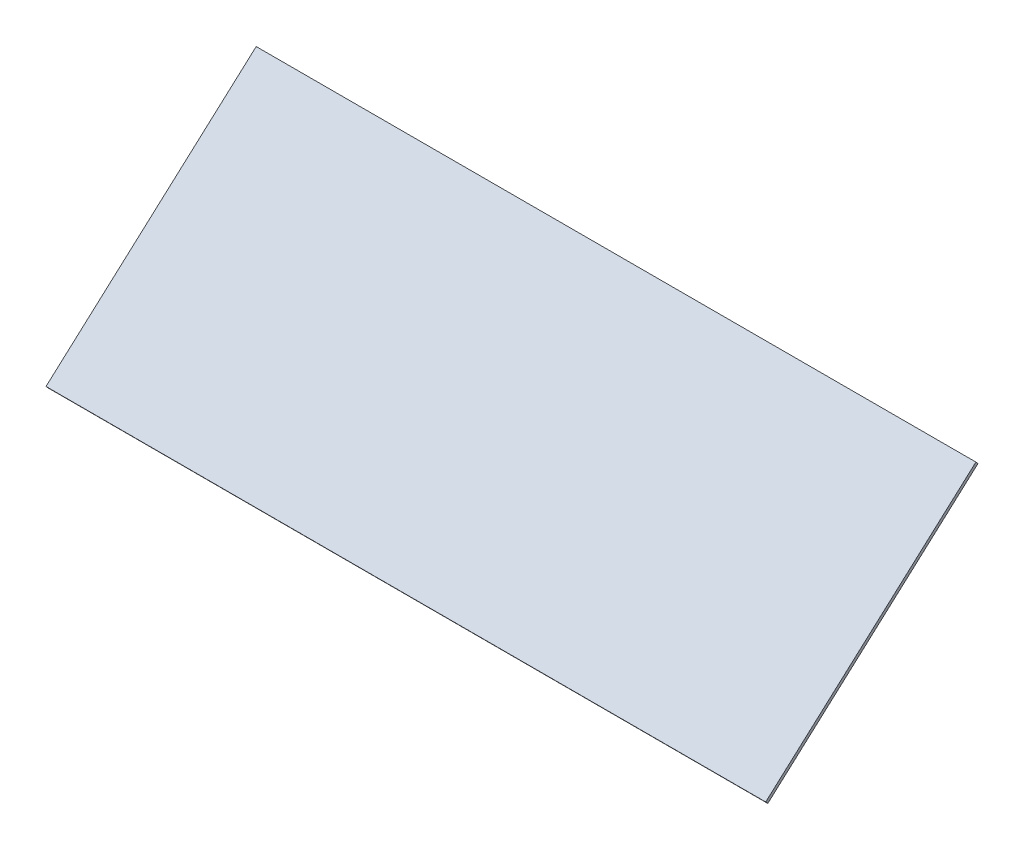
ISO-10303-21;
HEADER;
FILE_DESCRIPTION(('STEP AP214'),'2;1');
FILE_NAME('part.step','',(''),(''),'','','');
FILE_SCHEMA(('AUTOMOTIVE_DESIGN { 1 0 10303 214 1 1 1 1 }'));
ENDSEC;
DATA;
#1=APPLICATION_CONTEXT('core data for automotive mechanical design processes');
#2=APPLICATION_PROTOCOL_DEFINITION('international standard','automotive_design',2000,#1);
#3=PRODUCT_CONTEXT('',#1,'mechanical');
#4=PRODUCT('Part','Part','',(#3));
#5=PRODUCT_RELATED_PRODUCT_CATEGORY('part','',(#4));
#6=PRODUCT_DEFINITION_FORMATION('','',#4);
#7=PRODUCT_DEFINITION_CONTEXT('part definition',#1,'design');
#8=PRODUCT_DEFINITION('design','',#6,#7);
#9=PRODUCT_DEFINITION_SHAPE('','',#8);
#10=(LENGTH_UNIT() NAMED_UNIT(*) SI_UNIT(.MILLI.,.METRE.));
#11=(NAMED_UNIT(*) PLANE_ANGLE_UNIT() SI_UNIT($,.RADIAN.));
#12=(NAMED_UNIT(*) SI_UNIT($,.STERADIAN.) SOLID_ANGLE_UNIT());
#13=UNCERTAINTY_MEASURE_WITH_UNIT(LENGTH_MEASURE(1.E-05),#10,'distance_accuracy_value','');
#14=(GEOMETRIC_REPRESENTATION_CONTEXT(3) GLOBAL_UNCERTAINTY_ASSIGNED_CONTEXT((#13)) GLOBAL_UNIT_ASSIGNED_CONTEXT((#10,
#11,#12)) REPRESENTATION_CONTEXT('',''));
#15=CARTESIAN_POINT('',(0.,0.,0.));
#16=DIRECTION('',(0.,0.,1.));
#17=DIRECTION('',(1.,0.,0.));
#18=AXIS2_PLACEMENT_3D('',#15,#16,#17);
#19=CARTESIAN_POINT('',(114.5,-0.743144825477398,-0.669130606358855));
#20=DIRECTION('',(0.,0.743144825477397,0.669130606358855));
#21=DIRECTION('',(0.,-0.669130606358855,0.743144825477397));
#22=AXIS2_PLACEMENT_3D('',#19,#20,#21);
#23=PLANE('',#22);
#24=DIRECTION('',(0.,0.669130606358855,-0.743144825477398));
#25=VECTOR('',#24,1.);
#26=CARTESIAN_POINT('',(-114.5,-0.743144825477398,-0.669130606358855));
#27=LINE('',#26,#25);
#28=CARTESIAN_POINT('',(-114.5,-0.743144825477398,-0.669130606358855));
#29=VERTEX_POINT('',#28);
#30=CARTESIAN_POINT('',(-114.5,59.4786097468195,-67.5521648993246));
#31=VERTEX_POINT('',#30);
#32=EDGE_CURVE('E102',#29,#31,#27,.T.);
#33=ORIENTED_EDGE('',*,*,#32,.T.);
#34=DIRECTION('',(-1.,0.,0.));
#35=VECTOR('',#34,1.);
#36=CARTESIAN_POINT('',(114.5,59.4786097468195,-67.5521648993246));
#37=LINE('',#36,#35);
#38=CARTESIAN_POINT('',(114.5,59.4786097468195,-67.5521648993246));
#39=VERTEX_POINT('',#38);
#40=EDGE_CURVE('E11',#39,#31,#37,.T.);
#41=ORIENTED_EDGE('',*,*,#40,.F.);
#42=DIRECTION('',(0.,0.669130606358855,-0.743144825477398));
#43=VECTOR('',#42,1.);
#44=CARTESIAN_POINT('',(114.5,-0.743144825477398,-0.669130606358855));
#45=LINE('',#44,#43);
#46=CARTESIAN_POINT('',(114.5,-0.743144825477398,-0.669130606358855));
#47=VERTEX_POINT('',#46);
#48=EDGE_CURVE('E79',#47,#39,#45,.T.);
#49=ORIENTED_EDGE('',*,*,#48,.F.);
#50=DIRECTION('',(-1.,0.,0.));
#51=VECTOR('',#50,1.);
#52=CARTESIAN_POINT('',(114.5,-0.743144825477398,-0.669130606358855));
#53=LINE('',#52,#51);
#54=EDGE_CURVE('E55',#47,#29,#53,.T.);
#55=ORIENTED_EDGE('',*,*,#54,.T.);
#56=EDGE_LOOP('',(#33,#41,#49,#55));
#57=FACE_BOUND('',#56,.T.);
#58=ADVANCED_FACE('F39',(#57),#23,.F.);
#59=CARTESIAN_POINT('',(114.5,60.2217545722969,-66.8830342929658));
#60=DIRECTION('',(0.,0.669130606358856,-0.743144825477396));
#61=DIRECTION('',(0.,0.743144825477396,0.669130606358856));
#62=AXIS2_PLACEMENT_3D('',#59,#60,#61);
#63=PLANE('',#62);
#64=DIRECTION('',(0.,-0.743144825477396,-0.669130606358856));
#65=VECTOR('',#64,1.);
#66=CARTESIAN_POINT('',(-114.5,60.2217545722969,-66.8830342929658));
#67=LINE('',#66,#65);
#68=CARTESIAN_POINT('',(-114.5,60.2217545722969,-66.8830342929658));
#69=VERTEX_POINT('',#68);
#70=EDGE_CURVE('E88',#69,#31,#67,.T.);
#71=ORIENTED_EDGE('',*,*,#70,.F.);
#72=DIRECTION('',(-1.,0.,0.));
#73=VECTOR('',#72,1.);
#74=CARTESIAN_POINT('',(114.5,60.2217545722969,-66.8830342929658));
#75=LINE('',#74,#73);
#76=CARTESIAN_POINT('',(114.5,60.2217545722969,-66.8830342929658));
#77=VERTEX_POINT('',#76);
#78=EDGE_CURVE('E47',#77,#69,#75,.T.);
#79=ORIENTED_EDGE('',*,*,#78,.F.);
#80=DIRECTION('',(0.,-0.743144825477396,-0.669130606358856));
#81=VECTOR('',#80,1.);
#82=CARTESIAN_POINT('',(114.5,60.2217545722969,-66.8830342929658));
#83=LINE('',#82,#81);
#84=EDGE_CURVE('E86',#77,#39,#83,.T.);
#85=ORIENTED_EDGE('',*,*,#84,.T.);
#86=ORIENTED_EDGE('',*,*,#40,.T.);
#87=EDGE_LOOP('',(#71,#79,#85,#86));
#88=FACE_BOUND('',#87,.T.);
#89=ADVANCED_FACE('F85',(#88),#63,.T.);
#90=CARTESIAN_POINT('',(114.5,0.,0.));
#91=DIRECTION('',(0.,0.743144825477398,0.669130606358854));
#92=DIRECTION('',(0.,-0.669130606358855,0.743144825477398));
#93=AXIS2_PLACEMENT_3D('',#90,#91,#92);
#94=PLANE('',#93);
#95=DIRECTION('',(0.,0.669130606358854,-0.743144825477397));
#96=VECTOR('',#95,1.);
#97=CARTESIAN_POINT('',(-114.5,0.,0.));
#98=LINE('',#97,#96);
#99=CARTESIAN_POINT('',(-114.5,0.,0.));
#100=VERTEX_POINT('',#99);
#101=EDGE_CURVE('E105',#100,#69,#98,.T.);
#102=ORIENTED_EDGE('',*,*,#101,.F.);
#103=DIRECTION('',(-1.,0.,0.));
#104=VECTOR('',#103,1.);
#105=CARTESIAN_POINT('',(114.5,0.,0.));
#106=LINE('',#105,#104);
#107=CARTESIAN_POINT('',(114.5,0.,0.));
#108=VERTEX_POINT('',#107);
#109=EDGE_CURVE('E68',#108,#100,#106,.T.);
#110=ORIENTED_EDGE('',*,*,#109,.F.);
#111=DIRECTION('',(0.,0.669130606358854,-0.743144825477397));
#112=VECTOR('',#111,1.);
#113=CARTESIAN_POINT('',(114.5,0.,0.));
#114=LINE('',#113,#112);
#115=EDGE_CURVE('E94',#108,#77,#114,.T.);
#116=ORIENTED_EDGE('',*,*,#115,.T.);
#117=ORIENTED_EDGE('',*,*,#78,.T.);
#118=EDGE_LOOP('',(#102,#110,#116,#117));
#119=FACE_BOUND('',#118,.T.);
#120=ADVANCED_FACE('F96',(#119),#94,.T.);
#121=CARTESIAN_POINT('',(114.5,-0.743144825477398,-0.669130606358855));
#122=DIRECTION('',(0.,-0.669130606358855,0.743144825477398));
#123=DIRECTION('',(0.,-0.743144825477398,-0.669130606358855));
#124=AXIS2_PLACEMENT_3D('',#121,#122,#123);
#125=PLANE('',#124);
#126=DIRECTION('',(0.,0.743144825477398,0.669130606358855));
#127=VECTOR('',#126,1.);
#128=CARTESIAN_POINT('',(-114.5,-0.743144825477398,-0.669130606358855));
#129=LINE('',#128,#127);
#130=EDGE_CURVE('E107',#29,#100,#129,.T.);
#131=ORIENTED_EDGE('',*,*,#130,.F.);
#132=ORIENTED_EDGE('',*,*,#54,.F.);
#133=DIRECTION('',(0.,0.743144825477398,0.669130606358855));
#134=VECTOR('',#133,1.);
#135=CARTESIAN_POINT('',(114.5,-0.743144825477398,-0.669130606358855));
#136=LINE('',#135,#134);
#137=EDGE_CURVE('E97',#47,#108,#136,.T.);
#138=ORIENTED_EDGE('',*,*,#137,.T.);
#139=ORIENTED_EDGE('',*,*,#109,.T.);
#140=EDGE_LOOP('',(#131,#132,#138,#139));
#141=FACE_BOUND('',#140,.T.);
#142=ADVANCED_FACE('F113',(#141),#125,.T.);
#143=CARTESIAN_POINT('',(114.5,0.,0.));
#144=DIRECTION('',(-1.,0.,0.));
#145=DIRECTION('',(0.,0.,1.));
#146=AXIS2_PLACEMENT_3D('',#143,#144,#145);
#147=PLANE('',#146);
#148=ORIENTED_EDGE('',*,*,#48,.T.);
#149=ORIENTED_EDGE('',*,*,#84,.F.);
#150=ORIENTED_EDGE('',*,*,#115,.F.);
#151=ORIENTED_EDGE('',*,*,#137,.F.);
#152=EDGE_LOOP('',(#148,#149,#150,#151));
#153=FACE_BOUND('',#152,.T.);
#154=ADVANCED_FACE('F93',(#153),#147,.F.);
#155=CARTESIAN_POINT('',(-114.5,0.,0.));
#156=DIRECTION('',(-1.,0.,0.));
#157=DIRECTION('',(0.,0.,1.));
#158=AXIS2_PLACEMENT_3D('',#155,#156,#157);
#159=PLANE('',#158);
#160=ORIENTED_EDGE('',*,*,#32,.F.);
#161=ORIENTED_EDGE('',*,*,#130,.T.);
#162=ORIENTED_EDGE('',*,*,#101,.T.);
#163=ORIENTED_EDGE('',*,*,#70,.T.);
#164=EDGE_LOOP('',(#160,#161,#162,#163));
#165=FACE_BOUND('',#164,.T.);
#166=ADVANCED_FACE('F112',(#165),#159,.T.);
#167=CLOSED_SHELL('',(#58,#89,#120,#142,#154,#166));
#168=MANIFOLD_SOLID_BREP('B2',#167);
#169=ADVANCED_BREP_SHAPE_REPRESENTATION('',(#18,#168),#14);
#170=SHAPE_DEFINITION_REPRESENTATION(#9,#169);
ENDSEC;
END-ISO-10303-21;
